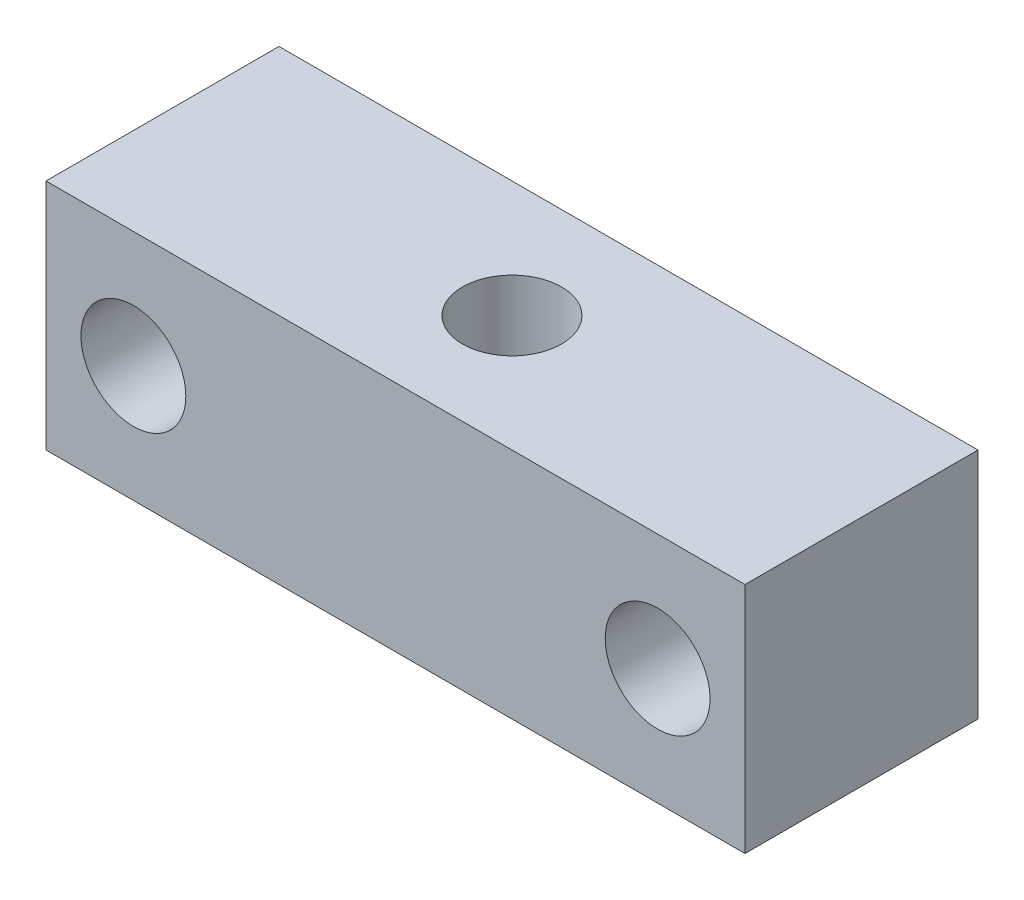
ISO-10303-21;
HEADER;
FILE_DESCRIPTION(('STEP AP214'),'2;1');
FILE_NAME('part.step','',(''),(''),'','','');
FILE_SCHEMA(('AUTOMOTIVE_DESIGN { 1 0 10303 214 1 1 1 1 }'));
ENDSEC;
DATA;
#1=APPLICATION_CONTEXT('core data for automotive mechanical design processes');
#2=APPLICATION_PROTOCOL_DEFINITION('international standard','automotive_design',2000,#1);
#3=PRODUCT_CONTEXT('',#1,'mechanical');
#4=PRODUCT('Part','Part','',(#3));
#5=PRODUCT_RELATED_PRODUCT_CATEGORY('part','',(#4));
#6=PRODUCT_DEFINITION_FORMATION('','',#4);
#7=PRODUCT_DEFINITION_CONTEXT('part definition',#1,'design');
#8=PRODUCT_DEFINITION('design','',#6,#7);
#9=PRODUCT_DEFINITION_SHAPE('','',#8);
#10=(LENGTH_UNIT() NAMED_UNIT(*) SI_UNIT(.MILLI.,.METRE.));
#11=(NAMED_UNIT(*) PLANE_ANGLE_UNIT() SI_UNIT($,.RADIAN.));
#12=(NAMED_UNIT(*) SI_UNIT($,.STERADIAN.) SOLID_ANGLE_UNIT());
#13=UNCERTAINTY_MEASURE_WITH_UNIT(LENGTH_MEASURE(1.E-05),#10,'distance_accuracy_value','');
#14=(GEOMETRIC_REPRESENTATION_CONTEXT(3) GLOBAL_UNCERTAINTY_ASSIGNED_CONTEXT((#13)) GLOBAL_UNIT_ASSIGNED_CONTEXT((#10,
#11,#12)) REPRESENTATION_CONTEXT('',''));
#15=CARTESIAN_POINT('',(0.,0.,0.));
#16=DIRECTION('',(0.,0.,1.));
#17=DIRECTION('',(1.,0.,0.));
#18=AXIS2_PLACEMENT_3D('',#15,#16,#17);
#19=CARTESIAN_POINT('',(0.,0.,20.));
#20=DIRECTION('',(0.,0.,1.));
#21=DIRECTION('',(1.,0.,0.));
#22=AXIS2_PLACEMENT_3D('',#19,#20,#21);
#23=PLANE('',#22);
#24=CARTESIAN_POINT('',(-22.5,0.,20.));
#25=DIRECTION('',(0.,0.,1.));
#26=DIRECTION('',(1.,0.,0.));
#27=AXIS2_PLACEMENT_3D('',#24,#25,#26);
#28=CIRCLE('',#27,4.5);
#29=CARTESIAN_POINT('',(-18.,0.,20.));
#30=VERTEX_POINT('',#29);
#31=EDGE_CURVE('E116',#30,#30,#28,.T.);
#32=ORIENTED_EDGE('',*,*,#31,.F.);
#33=EDGE_LOOP('',(#32));
#34=FACE_BOUND('',#33,.T.);
#35=DIRECTION('',(0.,1.,0.));
#36=VECTOR('',#35,1.);
#37=CARTESIAN_POINT('',(30.,10.,20.));
#38=LINE('',#37,#36);
#39=CARTESIAN_POINT('',(30.,-10.,20.));
#40=VERTEX_POINT('',#39);
#41=CARTESIAN_POINT('',(30.,10.,20.));
#42=VERTEX_POINT('',#41);
#43=EDGE_CURVE('E96',#40,#42,#38,.T.);
#44=ORIENTED_EDGE('',*,*,#43,.T.);
#45=DIRECTION('',(-1.,0.,0.));
#46=VECTOR('',#45,1.);
#47=CARTESIAN_POINT('',(-30.,10.,20.));
#48=LINE('',#47,#46);
#49=CARTESIAN_POINT('',(-30.,10.,20.));
#50=VERTEX_POINT('',#49);
#51=EDGE_CURVE('E91',#42,#50,#48,.T.);
#52=ORIENTED_EDGE('',*,*,#51,.T.);
#53=DIRECTION('',(0.,-1.,0.));
#54=VECTOR('',#53,1.);
#55=CARTESIAN_POINT('',(-30.,10.,20.));
#56=LINE('',#55,#54);
#57=CARTESIAN_POINT('',(-30.,-10.,20.));
#58=VERTEX_POINT('',#57);
#59=EDGE_CURVE('E94',#50,#58,#56,.T.);
#60=ORIENTED_EDGE('',*,*,#59,.T.);
#61=DIRECTION('',(1.,0.,0.));
#62=VECTOR('',#61,1.);
#63=CARTESIAN_POINT('',(-30.,-10.,20.));
#64=LINE('',#63,#62);
#65=EDGE_CURVE('E61',#58,#40,#64,.T.);
#66=ORIENTED_EDGE('',*,*,#65,.T.);
#67=EDGE_LOOP('',(#44,#52,#60,#66));
#68=FACE_BOUND('',#67,.T.);
#69=CARTESIAN_POINT('',(22.5,0.,20.));
#70=DIRECTION('',(0.,0.,1.));
#71=DIRECTION('',(-1.,0.,0.));
#72=AXIS2_PLACEMENT_3D('',#69,#70,#71);
#73=CIRCLE('',#72,4.5);
#74=CARTESIAN_POINT('',(18.,0.,20.));
#75=VERTEX_POINT('',#74);
#76=EDGE_CURVE('E138',#75,#75,#73,.T.);
#77=ORIENTED_EDGE('',*,*,#76,.F.);
#78=EDGE_LOOP('',(#77));
#79=FACE_BOUND('',#78,.T.);
#80=ADVANCED_FACE('F43',(#34,#68,#79),#23,.T.);
#81=CARTESIAN_POINT('',(0.,0.,0.));
#82=DIRECTION('',(0.,0.,1.));
#83=DIRECTION('',(1.,0.,0.));
#84=AXIS2_PLACEMENT_3D('',#81,#82,#83);
#85=PLANE('',#84);
#86=DIRECTION('',(0.,1.,0.));
#87=VECTOR('',#86,1.);
#88=CARTESIAN_POINT('',(30.,10.,0.));
#89=LINE('',#88,#87);
#90=CARTESIAN_POINT('',(30.,-10.,0.));
#91=VERTEX_POINT('',#90);
#92=CARTESIAN_POINT('',(30.,10.,0.));
#93=VERTEX_POINT('',#92);
#94=EDGE_CURVE('E112',#91,#93,#89,.T.);
#95=ORIENTED_EDGE('',*,*,#94,.F.);
#96=DIRECTION('',(1.,0.,0.));
#97=VECTOR('',#96,1.);
#98=CARTESIAN_POINT('',(-30.,-10.,0.));
#99=LINE('',#98,#97);
#100=CARTESIAN_POINT('',(-30.,-10.,0.));
#101=VERTEX_POINT('',#100);
#102=EDGE_CURVE('E84',#101,#91,#99,.T.);
#103=ORIENTED_EDGE('',*,*,#102,.F.);
#104=DIRECTION('',(0.,-1.,0.));
#105=VECTOR('',#104,1.);
#106=CARTESIAN_POINT('',(-30.,10.,0.));
#107=LINE('',#106,#105);
#108=CARTESIAN_POINT('',(-30.,10.,0.));
#109=VERTEX_POINT('',#108);
#110=EDGE_CURVE('E78',#109,#101,#107,.T.);
#111=ORIENTED_EDGE('',*,*,#110,.F.);
#112=DIRECTION('',(-1.,0.,0.));
#113=VECTOR('',#112,1.);
#114=CARTESIAN_POINT('',(-30.,10.,0.));
#115=LINE('',#114,#113);
#116=EDGE_CURVE('E101',#93,#109,#115,.T.);
#117=ORIENTED_EDGE('',*,*,#116,.F.);
#118=EDGE_LOOP('',(#95,#103,#111,#117));
#119=FACE_BOUND('',#118,.T.);
#120=CARTESIAN_POINT('',(-22.5,0.,0.));
#121=DIRECTION('',(0.,0.,1.));
#122=DIRECTION('',(1.,0.,0.));
#123=AXIS2_PLACEMENT_3D('',#120,#121,#122);
#124=CIRCLE('',#123,4.5);
#125=CARTESIAN_POINT('',(-18.,0.,0.));
#126=VERTEX_POINT('',#125);
#127=EDGE_CURVE('E134',#126,#126,#124,.T.);
#128=ORIENTED_EDGE('',*,*,#127,.T.);
#129=EDGE_LOOP('',(#128));
#130=FACE_BOUND('',#129,.T.);
#131=CARTESIAN_POINT('',(22.5,0.,0.));
#132=DIRECTION('',(0.,0.,1.));
#133=DIRECTION('',(-1.,0.,0.));
#134=AXIS2_PLACEMENT_3D('',#131,#132,#133);
#135=CIRCLE('',#134,4.5);
#136=CARTESIAN_POINT('',(18.,0.,0.));
#137=VERTEX_POINT('',#136);
#138=EDGE_CURVE('E142',#137,#137,#135,.T.);
#139=ORIENTED_EDGE('',*,*,#138,.T.);
#140=EDGE_LOOP('',(#139));
#141=FACE_BOUND('',#140,.T.);
#142=ADVANCED_FACE('F129',(#119,#130,#141),#85,.F.);
#143=CARTESIAN_POINT('',(30.,10.,20.));
#144=DIRECTION('',(-1.,0.,0.));
#145=DIRECTION('',(0.,-1.,0.));
#146=AXIS2_PLACEMENT_3D('',#143,#144,#145);
#147=PLANE('',#146);
#148=ORIENTED_EDGE('',*,*,#94,.T.);
#149=DIRECTION('',(0.,0.,-1.));
#150=VECTOR('',#149,1.);
#151=CARTESIAN_POINT('',(30.,10.,20.));
#152=LINE('',#151,#150);
#153=EDGE_CURVE('E11',#42,#93,#152,.T.);
#154=ORIENTED_EDGE('',*,*,#153,.F.);
#155=ORIENTED_EDGE('',*,*,#43,.F.);
#156=DIRECTION('',(0.,0.,-1.));
#157=VECTOR('',#156,1.);
#158=CARTESIAN_POINT('',(30.,-10.,20.));
#159=LINE('',#158,#157);
#160=EDGE_CURVE('E108',#40,#91,#159,.T.);
#161=ORIENTED_EDGE('',*,*,#160,.T.);
#162=EDGE_LOOP('',(#148,#154,#155,#161));
#163=FACE_BOUND('',#162,.T.);
#164=ADVANCED_FACE('F45',(#163),#147,.F.);
#165=CARTESIAN_POINT('',(-30.,10.,20.));
#166=DIRECTION('',(0.,-1.,0.));
#167=DIRECTION('',(0.,0.,-1.));
#168=AXIS2_PLACEMENT_3D('',#165,#166,#167);
#169=PLANE('',#168);
#170=CARTESIAN_POINT('',(0.,10.,10.));
#171=DIRECTION('',(0.,1.,0.));
#172=DIRECTION('',(0.,0.,1.));
#173=AXIS2_PLACEMENT_3D('',#170,#171,#172);
#174=CIRCLE('',#173,4.25);
#175=CARTESIAN_POINT('',(0.,10.,14.25));
#176=VERTEX_POINT('',#175);
#177=EDGE_CURVE('E153',#176,#176,#174,.T.);
#178=ORIENTED_EDGE('',*,*,#177,.F.);
#179=EDGE_LOOP('',(#178));
#180=FACE_BOUND('',#179,.T.);
#181=ORIENTED_EDGE('',*,*,#116,.T.);
#182=DIRECTION('',(0.,0.,-1.));
#183=VECTOR('',#182,1.);
#184=CARTESIAN_POINT('',(-30.,10.,20.));
#185=LINE('',#184,#183);
#186=EDGE_CURVE('E53',#50,#109,#185,.T.);
#187=ORIENTED_EDGE('',*,*,#186,.F.);
#188=ORIENTED_EDGE('',*,*,#51,.F.);
#189=ORIENTED_EDGE('',*,*,#153,.T.);
#190=EDGE_LOOP('',(#181,#187,#188,#189));
#191=FACE_BOUND('',#190,.T.);
#192=ADVANCED_FACE('F100',(#180,#191),#169,.F.);
#193=CARTESIAN_POINT('',(-30.,10.,20.));
#194=DIRECTION('',(1.,0.,0.));
#195=DIRECTION('',(0.,1.,0.));
#196=AXIS2_PLACEMENT_3D('',#193,#194,#195);
#197=PLANE('',#196);
#198=ORIENTED_EDGE('',*,*,#110,.T.);
#199=DIRECTION('',(0.,0.,-1.));
#200=VECTOR('',#199,1.);
#201=CARTESIAN_POINT('',(-30.,-10.,20.));
#202=LINE('',#201,#200);
#203=EDGE_CURVE('E103',#58,#101,#202,.T.);
#204=ORIENTED_EDGE('',*,*,#203,.F.);
#205=ORIENTED_EDGE('',*,*,#59,.F.);
#206=ORIENTED_EDGE('',*,*,#186,.T.);
#207=EDGE_LOOP('',(#198,#204,#205,#206));
#208=FACE_BOUND('',#207,.T.);
#209=ADVANCED_FACE('F104',(#208),#197,.F.);
#210=CARTESIAN_POINT('',(-30.,-10.,20.));
#211=DIRECTION('',(0.,1.,0.));
#212=DIRECTION('',(0.,0.,1.));
#213=AXIS2_PLACEMENT_3D('',#210,#211,#212);
#214=PLANE('',#213);
#215=CARTESIAN_POINT('',(0.,-10.,10.));
#216=DIRECTION('',(0.,1.,0.));
#217=DIRECTION('',(0.,0.,1.));
#218=AXIS2_PLACEMENT_3D('',#215,#216,#217);
#219=CIRCLE('',#218,4.25);
#220=CARTESIAN_POINT('',(0.,-10.,14.25));
#221=VERTEX_POINT('',#220);
#222=EDGE_CURVE('E146',#221,#221,#219,.T.);
#223=ORIENTED_EDGE('',*,*,#222,.T.);
#224=EDGE_LOOP('',(#223));
#225=FACE_BOUND('',#224,.T.);
#226=ORIENTED_EDGE('',*,*,#102,.T.);
#227=ORIENTED_EDGE('',*,*,#160,.F.);
#228=ORIENTED_EDGE('',*,*,#65,.F.);
#229=ORIENTED_EDGE('',*,*,#203,.T.);
#230=EDGE_LOOP('',(#226,#227,#228,#229));
#231=FACE_BOUND('',#230,.T.);
#232=ADVANCED_FACE('F126',(#225,#231),#214,.F.);
#233=CARTESIAN_POINT('',(-22.5,0.,20.));
#234=DIRECTION('',(0.,0.,-1.));
#235=DIRECTION('',(-1.,0.,0.));
#236=AXIS2_PLACEMENT_3D('',#233,#234,#235);
#237=CYLINDRICAL_SURFACE('',#236,4.5);
#238=ORIENTED_EDGE('',*,*,#31,.T.);
#239=EDGE_LOOP('',(#238));
#240=FACE_BOUND('',#239,.T.);
#241=ORIENTED_EDGE('',*,*,#127,.F.);
#242=EDGE_LOOP('',(#241));
#243=FACE_BOUND('',#242,.T.);
#244=ADVANCED_FACE('F176',(#240,#243),#237,.F.);
#245=CARTESIAN_POINT('',(22.5,0.,20.));
#246=DIRECTION('',(0.,0.,-1.));
#247=DIRECTION('',(-1.,0.,0.));
#248=AXIS2_PLACEMENT_3D('',#245,#246,#247);
#249=CYLINDRICAL_SURFACE('',#248,4.5);
#250=ORIENTED_EDGE('',*,*,#76,.T.);
#251=EDGE_LOOP('',(#250));
#252=FACE_BOUND('',#251,.T.);
#253=ORIENTED_EDGE('',*,*,#138,.F.);
#254=EDGE_LOOP('',(#253));
#255=FACE_BOUND('',#254,.T.);
#256=ADVANCED_FACE('F184',(#252,#255),#249,.F.);
#257=CARTESIAN_POINT('',(0.,10.,10.));
#258=DIRECTION('',(0.,1.,0.));
#259=DIRECTION('',(0.,0.,1.));
#260=AXIS2_PLACEMENT_3D('',#257,#258,#259);
#261=CYLINDRICAL_SURFACE('',#260,4.25);
#262=ORIENTED_EDGE('',*,*,#177,.T.);
#263=EDGE_LOOP('',(#262));
#264=FACE_BOUND('',#263,.T.);
#265=ORIENTED_EDGE('',*,*,#222,.F.);
#266=EDGE_LOOP('',(#265));
#267=FACE_BOUND('',#266,.T.);
#268=ADVANCED_FACE('F158',(#264,#267),#261,.F.);
#269=CLOSED_SHELL('',(#80,#142,#164,#192,#209,#232,#244,#256,#268));
#270=MANIFOLD_SOLID_BREP('B2',#269);
#271=ADVANCED_BREP_SHAPE_REPRESENTATION('',(#18,#270),#14);
#272=SHAPE_DEFINITION_REPRESENTATION(#9,#271);
ENDSEC;
END-ISO-10303-21;
